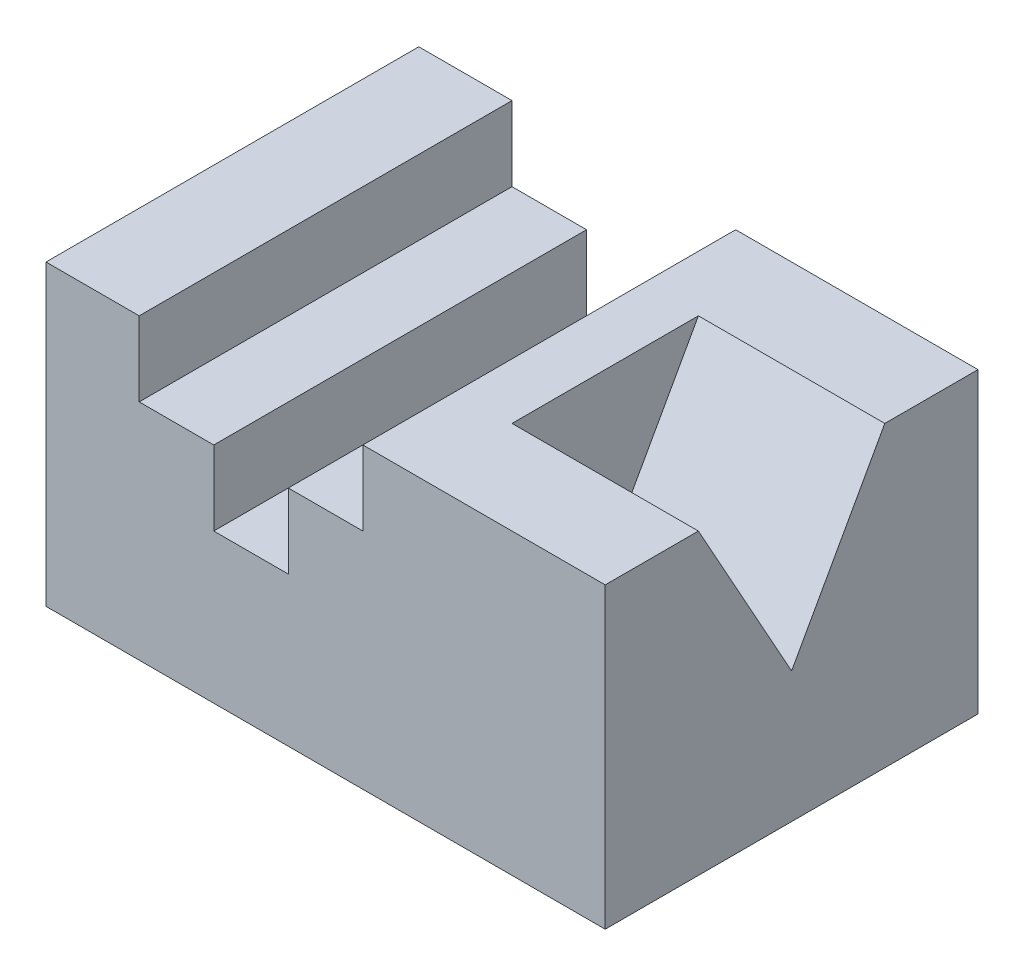
ISO-10303-21;
HEADER;
FILE_DESCRIPTION(('STEP AP214'),'2;1');
FILE_NAME('part.step','',(''),(''),'','','');
FILE_SCHEMA(('AUTOMOTIVE_DESIGN { 1 0 10303 214 1 1 1 1 }'));
ENDSEC;
DATA;
#1=APPLICATION_CONTEXT('core data for automotive mechanical design processes');
#2=APPLICATION_PROTOCOL_DEFINITION('international standard','automotive_design',2000,#1);
#3=PRODUCT_CONTEXT('',#1,'mechanical');
#4=PRODUCT('Part','Part','',(#3));
#5=PRODUCT_RELATED_PRODUCT_CATEGORY('part','',(#4));
#6=PRODUCT_DEFINITION_FORMATION('','',#4);
#7=PRODUCT_DEFINITION_CONTEXT('part definition',#1,'design');
#8=PRODUCT_DEFINITION('design','',#6,#7);
#9=PRODUCT_DEFINITION_SHAPE('','',#8);
#10=(LENGTH_UNIT() NAMED_UNIT(*) SI_UNIT(.MILLI.,.METRE.));
#11=(NAMED_UNIT(*) PLANE_ANGLE_UNIT() SI_UNIT($,.RADIAN.));
#12=(NAMED_UNIT(*) SI_UNIT($,.STERADIAN.) SOLID_ANGLE_UNIT());
#13=UNCERTAINTY_MEASURE_WITH_UNIT(LENGTH_MEASURE(1.E-05),#10,'distance_accuracy_value','');
#14=(GEOMETRIC_REPRESENTATION_CONTEXT(3) GLOBAL_UNCERTAINTY_ASSIGNED_CONTEXT((#13)) GLOBAL_UNIT_ASSIGNED_CONTEXT((#10,
#11,#12)) REPRESENTATION_CONTEXT('',''));
#15=CARTESIAN_POINT('',(0.,0.,0.));
#16=DIRECTION('',(0.,0.,1.));
#17=DIRECTION('',(1.,0.,0.));
#18=AXIS2_PLACEMENT_3D('',#15,#16,#17);
#19=CARTESIAN_POINT('',(0.,80.,0.));
#20=DIRECTION('',(0.,-1.,0.));
#21=DIRECTION('',(0.,0.,-1.));
#22=AXIS2_PLACEMENT_3D('',#19,#20,#21);
#23=PLANE('',#22);
#24=DIRECTION('',(0.,0.,-1.));
#25=VECTOR('',#24,1.);
#26=CARTESIAN_POINT('',(10.,80.,296.53853654145));
#27=LINE('',#26,#25);
#28=CARTESIAN_POINT('',(10.,80.,50.));
#29=VERTEX_POINT('',#28);
#30=CARTESIAN_POINT('',(10.,80.,-50.));
#31=VERTEX_POINT('',#30);
#32=EDGE_CURVE('E168',#29,#31,#27,.T.);
#33=ORIENTED_EDGE('',*,*,#32,.F.);
#34=DIRECTION('',(1.,0.,0.));
#35=VECTOR('',#34,1.);
#36=CARTESIAN_POINT('',(75.,80.,50.));
#37=LINE('',#36,#35);
#38=CARTESIAN_POINT('',(75.,80.,50.));
#39=VERTEX_POINT('',#38);
#40=EDGE_CURVE('E255',#29,#39,#37,.T.);
#41=ORIENTED_EDGE('',*,*,#40,.T.);
#42=DIRECTION('',(0.,0.,-1.));
#43=VECTOR('',#42,1.);
#44=CARTESIAN_POINT('',(75.,80.,-50.));
#45=LINE('',#44,#43);
#46=CARTESIAN_POINT('',(75.,80.,25.));
#47=VERTEX_POINT('',#46);
#48=EDGE_CURVE('E262',#39,#47,#45,.T.);
#49=ORIENTED_EDGE('',*,*,#48,.T.);
#50=DIRECTION('',(1.,0.,0.));
#51=VECTOR('',#50,1.);
#52=CARTESIAN_POINT('',(25.,80.,25.));
#53=LINE('',#52,#51);
#54=CARTESIAN_POINT('',(25.,80.,25.));
#55=VERTEX_POINT('',#54);
#56=EDGE_CURVE('E241',#55,#47,#53,.T.);
#57=ORIENTED_EDGE('',*,*,#56,.F.);
#58=DIRECTION('',(0.,0.,1.));
#59=VECTOR('',#58,1.);
#60=CARTESIAN_POINT('',(25.,80.,25.));
#61=LINE('',#60,#59);
#62=CARTESIAN_POINT('',(25.,80.,-25.));
#63=VERTEX_POINT('',#62);
#64=EDGE_CURVE('E231',#63,#55,#61,.T.);
#65=ORIENTED_EDGE('',*,*,#64,.F.);
#66=DIRECTION('',(1.,0.,0.));
#67=VECTOR('',#66,1.);
#68=CARTESIAN_POINT('',(25.,80.,-25.));
#69=LINE('',#68,#67);
#70=CARTESIAN_POINT('',(75.,80.,-25.));
#71=VERTEX_POINT('',#70);
#72=EDGE_CURVE('E245',#63,#71,#69,.T.);
#73=ORIENTED_EDGE('',*,*,#72,.T.);
#74=CARTESIAN_POINT('',(75.,80.,-50.));
#75=VERTEX_POINT('',#74);
#76=EDGE_CURVE('E261',#71,#75,#45,.T.);
#77=ORIENTED_EDGE('',*,*,#76,.T.);
#78=DIRECTION('',(-1.,0.,0.));
#79=VECTOR('',#78,1.);
#80=CARTESIAN_POINT('',(-75.,80.,-50.));
#81=LINE('',#80,#79);
#82=EDGE_CURVE('E267',#75,#31,#81,.T.);
#83=ORIENTED_EDGE('',*,*,#82,.T.);
#84=EDGE_LOOP('',(#33,#41,#49,#57,#65,#73,#77,#83));
#85=FACE_BOUND('',#84,.T.);
#86=ADVANCED_FACE('F43',(#85),#23,.F.);
#87=CARTESIAN_POINT('',(75.,80.,50.));
#88=DIRECTION('',(0.,0.,-1.));
#89=DIRECTION('',(-1.,0.,0.));
#90=AXIS2_PLACEMENT_3D('',#87,#88,#89);
#91=PLANE('',#90);
#92=DIRECTION('',(0.,-1.,0.));
#93=VECTOR('',#92,1.);
#94=CARTESIAN_POINT('',(-50.,80.,50.));
#95=LINE('',#94,#93);
#96=CARTESIAN_POINT('',(-50.,80.,50.));
#97=VERTEX_POINT('',#96);
#98=CARTESIAN_POINT('',(-50.,60.,50.));
#99=VERTEX_POINT('',#98);
#100=EDGE_CURVE('E219',#97,#99,#95,.T.);
#101=ORIENTED_EDGE('',*,*,#100,.F.);
#102=CARTESIAN_POINT('',(-75.,80.,50.));
#103=VERTEX_POINT('',#102);
#104=EDGE_CURVE('E257',#103,#97,#37,.T.);
#105=ORIENTED_EDGE('',*,*,#104,.F.);
#106=DIRECTION('',(0.,-1.,0.));
#107=VECTOR('',#106,1.);
#108=CARTESIAN_POINT('',(-75.,80.,50.));
#109=LINE('',#108,#107);
#110=CARTESIAN_POINT('',(-75.,0.,50.));
#111=VERTEX_POINT('',#110);
#112=EDGE_CURVE('E170',#103,#111,#109,.T.);
#113=ORIENTED_EDGE('',*,*,#112,.T.);
#114=DIRECTION('',(1.,0.,0.));
#115=VECTOR('',#114,1.);
#116=CARTESIAN_POINT('',(75.,0.,50.));
#117=LINE('',#116,#115);
#118=CARTESIAN_POINT('',(75.,0.,50.));
#119=VERTEX_POINT('',#118);
#120=EDGE_CURVE('E274',#111,#119,#117,.T.);
#121=ORIENTED_EDGE('',*,*,#120,.T.);
#122=DIRECTION('',(0.,-1.,0.));
#123=VECTOR('',#122,1.);
#124=CARTESIAN_POINT('',(75.,80.,50.));
#125=LINE('',#124,#123);
#126=EDGE_CURVE('E289',#39,#119,#125,.T.);
#127=ORIENTED_EDGE('',*,*,#126,.F.);
#128=ORIENTED_EDGE('',*,*,#40,.F.);
#129=DIRECTION('',(0.,1.,0.));
#130=VECTOR('',#129,1.);
#131=CARTESIAN_POINT('',(10.,80.,50.));
#132=LINE('',#131,#130);
#133=CARTESIAN_POINT('',(10.,60.,50.));
#134=VERTEX_POINT('',#133);
#135=EDGE_CURVE('E202',#134,#29,#132,.T.);
#136=ORIENTED_EDGE('',*,*,#135,.F.);
#137=DIRECTION('',(1.,0.,0.));
#138=VECTOR('',#137,1.);
#139=CARTESIAN_POINT('',(75.,60.,50.));
#140=LINE('',#139,#138);
#141=CARTESIAN_POINT('',(-9.99999999999997,60.,50.));
#142=VERTEX_POINT('',#141);
#143=EDGE_CURVE('E174',#142,#134,#140,.T.);
#144=ORIENTED_EDGE('',*,*,#143,.F.);
#145=DIRECTION('',(0.,1.,0.));
#146=VECTOR('',#145,1.);
#147=CARTESIAN_POINT('',(-9.99999999999997,80.,50.));
#148=LINE('',#147,#146);
#149=CARTESIAN_POINT('',(-9.99999999999996,40.,50.));
#150=VERTEX_POINT('',#149);
#151=EDGE_CURVE('E207',#150,#142,#148,.T.);
#152=ORIENTED_EDGE('',*,*,#151,.F.);
#153=DIRECTION('',(1.,0.,0.));
#154=VECTOR('',#153,1.);
#155=CARTESIAN_POINT('',(75.,40.,50.));
#156=LINE('',#155,#154);
#157=CARTESIAN_POINT('',(-30.,40.,50.));
#158=VERTEX_POINT('',#157);
#159=EDGE_CURVE('E211',#158,#150,#156,.T.);
#160=ORIENTED_EDGE('',*,*,#159,.F.);
#161=DIRECTION('',(0.,-1.,0.));
#162=VECTOR('',#161,1.);
#163=CARTESIAN_POINT('',(-30.,80.,50.));
#164=LINE('',#163,#162);
#165=CARTESIAN_POINT('',(-30.,60.,50.));
#166=VERTEX_POINT('',#165);
#167=EDGE_CURVE('E64',#166,#158,#164,.T.);
#168=ORIENTED_EDGE('',*,*,#167,.F.);
#169=DIRECTION('',(1.,0.,0.));
#170=VECTOR('',#169,1.);
#171=CARTESIAN_POINT('',(75.,60.,50.));
#172=LINE('',#171,#170);
#173=EDGE_CURVE('E59',#99,#166,#172,.T.);
#174=ORIENTED_EDGE('',*,*,#173,.F.);
#175=EDGE_LOOP('',(#101,#105,#113,#121,#127,#128,#136,#144,#152,#160,#168,#174));
#176=FACE_BOUND('',#175,.T.);
#177=ADVANCED_FACE('F314',(#176),#91,.F.);
#178=CARTESIAN_POINT('',(-75.,80.,-50.));
#179=DIRECTION('',(0.,0.,1.));
#180=DIRECTION('',(1.,0.,0.));
#181=AXIS2_PLACEMENT_3D('',#178,#179,#180);
#182=PLANE('',#181);
#183=DIRECTION('',(0.,1.,0.));
#184=VECTOR('',#183,1.);
#185=CARTESIAN_POINT('',(-50.,80.,-50.));
#186=LINE('',#185,#184);
#187=CARTESIAN_POINT('',(-50.,60.,-50.));
#188=VERTEX_POINT('',#187);
#189=CARTESIAN_POINT('',(-50.,80.,-50.));
#190=VERTEX_POINT('',#189);
#191=EDGE_CURVE('E11',#188,#190,#186,.T.);
#192=ORIENTED_EDGE('',*,*,#191,.F.);
#193=DIRECTION('',(-1.,0.,0.));
#194=VECTOR('',#193,1.);
#195=CARTESIAN_POINT('',(-75.,60.,-50.));
#196=LINE('',#195,#194);
#197=CARTESIAN_POINT('',(-30.,60.,-50.));
#198=VERTEX_POINT('',#197);
#199=EDGE_CURVE('E52',#198,#188,#196,.T.);
#200=ORIENTED_EDGE('',*,*,#199,.F.);
#201=DIRECTION('',(0.,1.,0.));
#202=VECTOR('',#201,1.);
#203=CARTESIAN_POINT('',(-30.,80.,-50.));
#204=LINE('',#203,#202);
#205=CARTESIAN_POINT('',(-30.,40.,-50.));
#206=VERTEX_POINT('',#205);
#207=EDGE_CURVE('E302',#206,#198,#204,.T.);
#208=ORIENTED_EDGE('',*,*,#207,.F.);
#209=DIRECTION('',(-1.,0.,0.));
#210=VECTOR('',#209,1.);
#211=CARTESIAN_POINT('',(-75.,40.,-50.));
#212=LINE('',#211,#210);
#213=CARTESIAN_POINT('',(-9.99999999999996,40.,-50.));
#214=VERTEX_POINT('',#213);
#215=EDGE_CURVE('E298',#214,#206,#212,.T.);
#216=ORIENTED_EDGE('',*,*,#215,.F.);
#217=DIRECTION('',(0.,-1.,0.));
#218=VECTOR('',#217,1.);
#219=CARTESIAN_POINT('',(-9.99999999999997,80.,-50.));
#220=LINE('',#219,#218);
#221=CARTESIAN_POINT('',(-9.99999999999997,60.,-50.));
#222=VERTEX_POINT('',#221);
#223=EDGE_CURVE('E155',#222,#214,#220,.T.);
#224=ORIENTED_EDGE('',*,*,#223,.F.);
#225=DIRECTION('',(-1.,0.,0.));
#226=VECTOR('',#225,1.);
#227=CARTESIAN_POINT('',(-75.,60.,-50.));
#228=LINE('',#227,#226);
#229=CARTESIAN_POINT('',(10.,60.,-49.9999999999999));
#230=VERTEX_POINT('',#229);
#231=EDGE_CURVE('E148',#230,#222,#228,.T.);
#232=ORIENTED_EDGE('',*,*,#231,.F.);
#233=DIRECTION('',(0.,-1.,0.));
#234=VECTOR('',#233,1.);
#235=CARTESIAN_POINT('',(10.,80.,-50.));
#236=LINE('',#235,#234);
#237=EDGE_CURVE('E152',#31,#230,#236,.T.);
#238=ORIENTED_EDGE('',*,*,#237,.F.);
#239=ORIENTED_EDGE('',*,*,#82,.F.);
#240=DIRECTION('',(0.,-1.,0.));
#241=VECTOR('',#240,1.);
#242=CARTESIAN_POINT('',(75.,80.,-50.));
#243=LINE('',#242,#241);
#244=CARTESIAN_POINT('',(75.,0.,-50.));
#245=VERTEX_POINT('',#244);
#246=EDGE_CURVE('E285',#75,#245,#243,.T.);
#247=ORIENTED_EDGE('',*,*,#246,.T.);
#248=DIRECTION('',(-1.,0.,0.));
#249=VECTOR('',#248,1.);
#250=CARTESIAN_POINT('',(-75.,0.,-50.));
#251=LINE('',#250,#249);
#252=CARTESIAN_POINT('',(-75.,0.,-50.));
#253=VERTEX_POINT('',#252);
#254=EDGE_CURVE('E256',#245,#253,#251,.T.);
#255=ORIENTED_EDGE('',*,*,#254,.T.);
#256=DIRECTION('',(0.,-1.,0.));
#257=VECTOR('',#256,1.);
#258=CARTESIAN_POINT('',(-75.,80.,-50.));
#259=LINE('',#258,#257);
#260=CARTESIAN_POINT('',(-75.,80.,-50.));
#261=VERTEX_POINT('',#260);
#262=EDGE_CURVE('E270',#261,#253,#259,.T.);
#263=ORIENTED_EDGE('',*,*,#262,.F.);
#264=EDGE_CURVE('E266',#190,#261,#81,.T.);
#265=ORIENTED_EDGE('',*,*,#264,.F.);
#266=EDGE_LOOP('',(#192,#200,#208,#216,#224,#232,#238,#239,#247,#255,#263,#265));
#267=FACE_BOUND('',#266,.T.);
#268=ADVANCED_FACE('F150',(#267),#182,.F.);
#269=CARTESIAN_POINT('',(-75.,80.,50.));
#270=DIRECTION('',(1.,0.,0.));
#271=DIRECTION('',(0.,0.,-1.));
#272=AXIS2_PLACEMENT_3D('',#269,#270,#271);
#273=PLANE('',#272);
#274=DIRECTION('',(0.,0.,1.));
#275=VECTOR('',#274,1.);
#276=CARTESIAN_POINT('',(-75.,0.,50.));
#277=LINE('',#276,#275);
#278=EDGE_CURVE('E244',#253,#111,#277,.T.);
#279=ORIENTED_EDGE('',*,*,#278,.T.);
#280=ORIENTED_EDGE('',*,*,#112,.F.);
#281=DIRECTION('',(0.,0.,1.));
#282=VECTOR('',#281,1.);
#283=CARTESIAN_POINT('',(-75.,80.,50.));
#284=LINE('',#283,#282);
#285=EDGE_CURVE('E251',#261,#103,#284,.T.);
#286=ORIENTED_EDGE('',*,*,#285,.F.);
#287=ORIENTED_EDGE('',*,*,#262,.T.);
#288=EDGE_LOOP('',(#279,#280,#286,#287));
#289=FACE_BOUND('',#288,.T.);
#290=ADVANCED_FACE('F45',(#289),#273,.F.);
#291=CARTESIAN_POINT('',(75.,80.,-50.));
#292=DIRECTION('',(-1.,0.,0.));
#293=DIRECTION('',(0.,0.,1.));
#294=AXIS2_PLACEMENT_3D('',#291,#292,#293);
#295=PLANE('',#294);
#296=DIRECTION('',(0.,0.874157276121538,-0.485642931178632));
#297=VECTOR('',#296,1.);
#298=CARTESIAN_POINT('',(75.,80.,-25.));
#299=LINE('',#298,#297);
#300=CARTESIAN_POINT('',(75.,35.,0.));
#301=VERTEX_POINT('',#300);
#302=EDGE_CURVE('E228',#301,#71,#299,.T.);
#303=ORIENTED_EDGE('',*,*,#302,.F.);
#304=DIRECTION('',(0.,-0.874157276121538,-0.485642931178632));
#305=VECTOR('',#304,1.);
#306=CARTESIAN_POINT('',(75.,35.,0.));
#307=LINE('',#306,#305);
#308=EDGE_CURVE('E222',#47,#301,#307,.T.);
#309=ORIENTED_EDGE('',*,*,#308,.F.);
#310=ORIENTED_EDGE('',*,*,#48,.F.);
#311=ORIENTED_EDGE('',*,*,#126,.T.);
#312=DIRECTION('',(0.,0.,-1.));
#313=VECTOR('',#312,1.);
#314=CARTESIAN_POINT('',(75.,0.,-50.));
#315=LINE('',#314,#313);
#316=EDGE_CURVE('E277',#119,#245,#315,.T.);
#317=ORIENTED_EDGE('',*,*,#316,.T.);
#318=ORIENTED_EDGE('',*,*,#246,.F.);
#319=ORIENTED_EDGE('',*,*,#76,.F.);
#320=EDGE_LOOP('',(#303,#309,#310,#311,#317,#318,#319));
#321=FACE_BOUND('',#320,.T.);
#322=ADVANCED_FACE('F330',(#321),#295,.F.);
#323=ORIENTED_EDGE('',*,*,#104,.T.);
#324=DIRECTION('',(0.,0.,-1.));
#325=VECTOR('',#324,1.);
#326=CARTESIAN_POINT('',(-50.,80.,296.53853654145));
#327=LINE('',#326,#325);
#328=EDGE_CURVE('E199',#97,#190,#327,.T.);
#329=ORIENTED_EDGE('',*,*,#328,.T.);
#330=ORIENTED_EDGE('',*,*,#264,.T.);
#331=ORIENTED_EDGE('',*,*,#285,.T.);
#332=EDGE_LOOP('',(#323,#329,#330,#331));
#333=FACE_BOUND('',#332,.T.);
#334=ADVANCED_FACE('F316',(#333),#23,.F.);
#335=CARTESIAN_POINT('',(0.,0.,0.));
#336=DIRECTION('',(0.,-1.,0.));
#337=DIRECTION('',(0.,0.,-1.));
#338=AXIS2_PLACEMENT_3D('',#335,#336,#337);
#339=PLANE('',#338);
#340=ORIENTED_EDGE('',*,*,#278,.F.);
#341=ORIENTED_EDGE('',*,*,#254,.F.);
#342=ORIENTED_EDGE('',*,*,#316,.F.);
#343=ORIENTED_EDGE('',*,*,#120,.F.);
#344=EDGE_LOOP('',(#340,#341,#342,#343));
#345=FACE_BOUND('',#344,.T.);
#346=ADVANCED_FACE('F334',(#345),#339,.T.);
#347=CARTESIAN_POINT('',(25.,35.,0.));
#348=DIRECTION('',(0.,-0.485642931178632,0.874157276121538));
#349=DIRECTION('',(0.,-0.874157276121538,-0.485642931178632));
#350=AXIS2_PLACEMENT_3D('',#347,#348,#349);
#351=PLANE('',#350);
#352=ORIENTED_EDGE('',*,*,#308,.T.);
#353=DIRECTION('',(1.,0.,0.));
#354=VECTOR('',#353,1.);
#355=CARTESIAN_POINT('',(25.,35.,0.));
#356=LINE('',#355,#354);
#357=CARTESIAN_POINT('',(25.,35.,0.));
#358=VERTEX_POINT('',#357);
#359=EDGE_CURVE('E235',#358,#301,#356,.T.);
#360=ORIENTED_EDGE('',*,*,#359,.F.);
#361=DIRECTION('',(0.,-0.874157276121538,-0.485642931178632));
#362=VECTOR('',#361,1.);
#363=CARTESIAN_POINT('',(25.,35.,0.));
#364=LINE('',#363,#362);
#365=EDGE_CURVE('E223',#55,#358,#364,.T.);
#366=ORIENTED_EDGE('',*,*,#365,.F.);
#367=ORIENTED_EDGE('',*,*,#56,.T.);
#368=EDGE_LOOP('',(#352,#360,#366,#367));
#369=FACE_BOUND('',#368,.T.);
#370=ADVANCED_FACE('F369',(#369),#351,.F.);
#371=CARTESIAN_POINT('',(25.,80.,-25.));
#372=DIRECTION('',(0.,-0.485642931178632,-0.874157276121538));
#373=DIRECTION('',(0.,0.874157276121538,-0.485642931178632));
#374=AXIS2_PLACEMENT_3D('',#371,#372,#373);
#375=PLANE('',#374);
#376=ORIENTED_EDGE('',*,*,#302,.T.);
#377=ORIENTED_EDGE('',*,*,#72,.F.);
#378=DIRECTION('',(0.,0.874157276121538,-0.485642931178632));
#379=VECTOR('',#378,1.);
#380=CARTESIAN_POINT('',(25.,80.,-25.));
#381=LINE('',#380,#379);
#382=EDGE_CURVE('E227',#358,#63,#381,.T.);
#383=ORIENTED_EDGE('',*,*,#382,.F.);
#384=ORIENTED_EDGE('',*,*,#359,.T.);
#385=EDGE_LOOP('',(#376,#377,#383,#384));
#386=FACE_BOUND('',#385,.T.);
#387=ADVANCED_FACE('F407',(#386),#375,.F.);
#388=CARTESIAN_POINT('',(25.,0.,0.));
#389=DIRECTION('',(-1.,0.,0.));
#390=DIRECTION('',(0.,0.,1.));
#391=AXIS2_PLACEMENT_3D('',#388,#389,#390);
#392=PLANE('',#391);
#393=ORIENTED_EDGE('',*,*,#365,.T.);
#394=ORIENTED_EDGE('',*,*,#382,.T.);
#395=ORIENTED_EDGE('',*,*,#64,.T.);
#396=EDGE_LOOP('',(#393,#394,#395));
#397=FACE_BOUND('',#396,.T.);
#398=ADVANCED_FACE('F417',(#397),#392,.F.);
#399=CARTESIAN_POINT('',(-50.,80.,296.53853654145));
#400=DIRECTION('',(1.,0.,0.));
#401=DIRECTION('',(0.,0.,-1.));
#402=AXIS2_PLACEMENT_3D('',#399,#400,#401);
#403=PLANE('',#402);
#404=ORIENTED_EDGE('',*,*,#328,.F.);
#405=ORIENTED_EDGE('',*,*,#100,.T.);
#406=DIRECTION('',(0.,0.,-1.));
#407=VECTOR('',#406,1.);
#408=CARTESIAN_POINT('',(-50.,60.,296.53853654145));
#409=LINE('',#408,#407);
#410=EDGE_CURVE('E195',#99,#188,#409,.T.);
#411=ORIENTED_EDGE('',*,*,#410,.T.);
#412=ORIENTED_EDGE('',*,*,#191,.T.);
#413=EDGE_LOOP('',(#404,#405,#411,#412));
#414=FACE_BOUND('',#413,.T.);
#415=ADVANCED_FACE('F313',(#414),#403,.T.);
#416=CARTESIAN_POINT('',(-50.,60.,296.53853654145));
#417=DIRECTION('',(0.,1.,0.));
#418=DIRECTION('',(0.,0.,1.));
#419=AXIS2_PLACEMENT_3D('',#416,#417,#418);
#420=PLANE('',#419);
#421=ORIENTED_EDGE('',*,*,#410,.F.);
#422=ORIENTED_EDGE('',*,*,#173,.T.);
#423=DIRECTION('',(0.,0.,-1.));
#424=VECTOR('',#423,1.);
#425=CARTESIAN_POINT('',(-30.,60.,296.53853654145));
#426=LINE('',#425,#424);
#427=EDGE_CURVE('E191',#166,#198,#426,.T.);
#428=ORIENTED_EDGE('',*,*,#427,.T.);
#429=ORIENTED_EDGE('',*,*,#199,.T.);
#430=EDGE_LOOP('',(#421,#422,#428,#429));
#431=FACE_BOUND('',#430,.T.);
#432=ADVANCED_FACE('F309',(#431),#420,.T.);
#433=CARTESIAN_POINT('',(-30.,60.,296.53853654145));
#434=DIRECTION('',(1.,0.,0.));
#435=DIRECTION('',(0.,0.,-1.));
#436=AXIS2_PLACEMENT_3D('',#433,#434,#435);
#437=PLANE('',#436);
#438=ORIENTED_EDGE('',*,*,#427,.F.);
#439=ORIENTED_EDGE('',*,*,#167,.T.);
#440=DIRECTION('',(0.,0.,-1.));
#441=VECTOR('',#440,1.);
#442=CARTESIAN_POINT('',(-30.,40.,296.53853654145));
#443=LINE('',#442,#441);
#444=EDGE_CURVE('E187',#158,#206,#443,.T.);
#445=ORIENTED_EDGE('',*,*,#444,.T.);
#446=ORIENTED_EDGE('',*,*,#207,.T.);
#447=EDGE_LOOP('',(#438,#439,#445,#446));
#448=FACE_BOUND('',#447,.T.);
#449=ADVANCED_FACE('F348',(#448),#437,.T.);
#450=CARTESIAN_POINT('',(-30.,40.,296.53853654145));
#451=DIRECTION('',(0.,1.,0.));
#452=DIRECTION('',(0.,0.,1.));
#453=AXIS2_PLACEMENT_3D('',#450,#451,#452);
#454=PLANE('',#453);
#455=ORIENTED_EDGE('',*,*,#444,.F.);
#456=ORIENTED_EDGE('',*,*,#159,.T.);
#457=DIRECTION('',(0.,0.,-1.));
#458=VECTOR('',#457,1.);
#459=CARTESIAN_POINT('',(-9.99999999999997,40.,296.53853654145));
#460=LINE('',#459,#458);
#461=EDGE_CURVE('E183',#150,#214,#460,.T.);
#462=ORIENTED_EDGE('',*,*,#461,.T.);
#463=ORIENTED_EDGE('',*,*,#215,.T.);
#464=EDGE_LOOP('',(#455,#456,#462,#463));
#465=FACE_BOUND('',#464,.T.);
#466=ADVANCED_FACE('F346',(#465),#454,.T.);
#467=CARTESIAN_POINT('',(-9.99999999999997,40.,296.53853654145));
#468=DIRECTION('',(-1.,0.,0.));
#469=DIRECTION('',(0.,-1.,0.));
#470=AXIS2_PLACEMENT_3D('',#467,#468,#469);
#471=PLANE('',#470);
#472=ORIENTED_EDGE('',*,*,#461,.F.);
#473=ORIENTED_EDGE('',*,*,#151,.T.);
#474=DIRECTION('',(0.,0.,-1.));
#475=VECTOR('',#474,1.);
#476=CARTESIAN_POINT('',(-9.99999999999997,60.,296.53853654145));
#477=LINE('',#476,#475);
#478=EDGE_CURVE('E178',#142,#222,#477,.T.);
#479=ORIENTED_EDGE('',*,*,#478,.T.);
#480=ORIENTED_EDGE('',*,*,#223,.T.);
#481=EDGE_LOOP('',(#472,#473,#479,#480));
#482=FACE_BOUND('',#481,.T.);
#483=ADVANCED_FACE('F343',(#482),#471,.T.);
#484=CARTESIAN_POINT('',(-9.99999999999997,60.,296.53853654145));
#485=DIRECTION('',(0.,1.,0.));
#486=DIRECTION('',(0.,0.,1.));
#487=AXIS2_PLACEMENT_3D('',#484,#485,#486);
#488=PLANE('',#487);
#489=ORIENTED_EDGE('',*,*,#478,.F.);
#490=ORIENTED_EDGE('',*,*,#143,.T.);
#491=DIRECTION('',(0.,0.,-1.));
#492=VECTOR('',#491,1.);
#493=CARTESIAN_POINT('',(10.,60.,296.53853654145));
#494=LINE('',#493,#492);
#495=EDGE_CURVE('E167',#134,#230,#494,.T.);
#496=ORIENTED_EDGE('',*,*,#495,.T.);
#497=ORIENTED_EDGE('',*,*,#231,.T.);
#498=EDGE_LOOP('',(#489,#490,#496,#497));
#499=FACE_BOUND('',#498,.T.);
#500=ADVANCED_FACE('F173',(#499),#488,.T.);
#501=CARTESIAN_POINT('',(10.,60.,296.53853654145));
#502=DIRECTION('',(-1.,0.,0.));
#503=DIRECTION('',(0.,0.,1.));
#504=AXIS2_PLACEMENT_3D('',#501,#502,#503);
#505=PLANE('',#504);
#506=ORIENTED_EDGE('',*,*,#495,.F.);
#507=ORIENTED_EDGE('',*,*,#135,.T.);
#508=ORIENTED_EDGE('',*,*,#32,.T.);
#509=ORIENTED_EDGE('',*,*,#237,.T.);
#510=EDGE_LOOP('',(#506,#507,#508,#509));
#511=FACE_BOUND('',#510,.T.);
#512=ADVANCED_FACE('F165',(#511),#505,.T.);
#513=CLOSED_SHELL('',(#86,#177,#268,#290,#322,#334,#346,#370,#387,#398,#415,#432,#449,#466,#483,
#500,#512));
#514=MANIFOLD_SOLID_BREP('B2',#513);
#515=ADVANCED_BREP_SHAPE_REPRESENTATION('',(#18,#514),#14);
#516=SHAPE_DEFINITION_REPRESENTATION(#9,#515);
ENDSEC;
END-ISO-10303-21;
